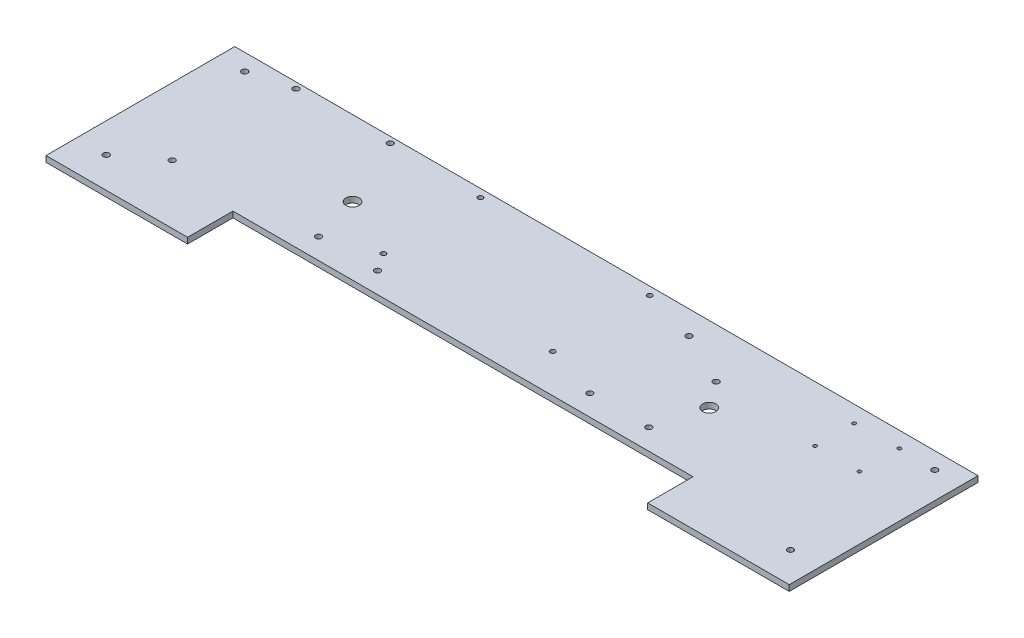
ISO-10303-21;
HEADER;
FILE_DESCRIPTION(('STEP AP214'),'2;1');
FILE_NAME('part.step','',(''),(''),'','','');
FILE_SCHEMA(('AUTOMOTIVE_DESIGN { 1 0 10303 214 1 1 1 1 }'));
ENDSEC;
DATA;
#1=APPLICATION_CONTEXT('core data for automotive mechanical design processes');
#2=APPLICATION_PROTOCOL_DEFINITION('international standard','automotive_design',2000,#1);
#3=PRODUCT_CONTEXT('',#1,'mechanical');
#4=PRODUCT('Part','Part','',(#3));
#5=PRODUCT_RELATED_PRODUCT_CATEGORY('part','',(#4));
#6=PRODUCT_DEFINITION_FORMATION('','',#4);
#7=PRODUCT_DEFINITION_CONTEXT('part definition',#1,'design');
#8=PRODUCT_DEFINITION('design','',#6,#7);
#9=PRODUCT_DEFINITION_SHAPE('','',#8);
#10=(LENGTH_UNIT() NAMED_UNIT(*) SI_UNIT(.MILLI.,.METRE.));
#11=(NAMED_UNIT(*) PLANE_ANGLE_UNIT() SI_UNIT($,.RADIAN.));
#12=(NAMED_UNIT(*) SI_UNIT($,.STERADIAN.) SOLID_ANGLE_UNIT());
#13=UNCERTAINTY_MEASURE_WITH_UNIT(LENGTH_MEASURE(1.E-05),#10,'distance_accuracy_value','');
#14=(GEOMETRIC_REPRESENTATION_CONTEXT(3) GLOBAL_UNCERTAINTY_ASSIGNED_CONTEXT((#13)) GLOBAL_UNIT_ASSIGNED_CONTEXT((#10,
#11,#12)) REPRESENTATION_CONTEXT('',''));
#15=CARTESIAN_POINT('',(0.,0.,0.));
#16=DIRECTION('',(0.,0.,1.));
#17=DIRECTION('',(1.,0.,0.));
#18=AXIS2_PLACEMENT_3D('',#15,#16,#17);
#19=CARTESIAN_POINT('',(647.7,6.35,48.8187999999998));
#20=DIRECTION('',(-1.,0.,0.));
#21=DIRECTION('',(0.,0.,1.));
#22=AXIS2_PLACEMENT_3D('',#19,#20,#21);
#23=PLANE('',#22);
#24=DIRECTION('',(0.,0.,-1.));
#25=VECTOR('',#24,1.);
#26=CARTESIAN_POINT('',(647.7,0.,48.8187999999998));
#27=LINE('',#26,#25);
#28=CARTESIAN_POINT('',(647.7,0.,48.8187999999998));
#29=VERTEX_POINT('',#28);
#30=CARTESIAN_POINT('',(647.7,0.,-154.3812));
#31=VERTEX_POINT('',#30);
#32=EDGE_CURVE('E136',#29,#31,#27,.T.);
#33=ORIENTED_EDGE('',*,*,#32,.T.);
#34=DIRECTION('',(0.,-1.,0.));
#35=VECTOR('',#34,1.);
#36=CARTESIAN_POINT('',(647.7,6.35,-154.3812));
#37=LINE('',#36,#35);
#38=CARTESIAN_POINT('',(647.7,6.35,-154.3812));
#39=VERTEX_POINT('',#38);
#40=EDGE_CURVE('E12',#39,#31,#37,.T.);
#41=ORIENTED_EDGE('',*,*,#40,.F.);
#42=DIRECTION('',(0.,0.,-1.));
#43=VECTOR('',#42,1.);
#44=CARTESIAN_POINT('',(647.7,6.35,48.8187999999998));
#45=LINE('',#44,#43);
#46=CARTESIAN_POINT('',(647.7,6.35,48.8187999999998));
#47=VERTEX_POINT('',#46);
#48=EDGE_CURVE('E426',#47,#39,#45,.T.);
#49=ORIENTED_EDGE('',*,*,#48,.F.);
#50=DIRECTION('',(0.,-1.,0.));
#51=VECTOR('',#50,1.);
#52=CARTESIAN_POINT('',(647.7,6.35,48.8187999999998));
#53=LINE('',#52,#51);
#54=EDGE_CURVE('E132',#47,#29,#53,.T.);
#55=ORIENTED_EDGE('',*,*,#54,.T.);
#56=EDGE_LOOP('',(#33,#41,#49,#55));
#57=FACE_BOUND('',#56,.T.);
#58=ADVANCED_FACE('F37',(#57),#23,.F.);
#59=CARTESIAN_POINT('',(647.7,6.35,-154.3812));
#60=DIRECTION('',(0.,0.,1.));
#61=DIRECTION('',(1.,0.,0.));
#62=AXIS2_PLACEMENT_3D('',#59,#60,#61);
#63=PLANE('',#62);
#64=DIRECTION('',(-1.,0.,0.));
#65=VECTOR('',#64,1.);
#66=CARTESIAN_POINT('',(647.7,0.,-154.3812));
#67=LINE('',#66,#65);
#68=CARTESIAN_POINT('',(-152.4,0.,-154.3812));
#69=VERTEX_POINT('',#68);
#70=EDGE_CURVE('E139',#31,#69,#67,.T.);
#71=ORIENTED_EDGE('',*,*,#70,.T.);
#72=DIRECTION('',(0.,-1.,0.));
#73=VECTOR('',#72,1.);
#74=CARTESIAN_POINT('',(-152.4,6.35,-154.3812));
#75=LINE('',#74,#73);
#76=CARTESIAN_POINT('',(-152.4,6.35,-154.3812));
#77=VERTEX_POINT('',#76);
#78=EDGE_CURVE('E47',#77,#69,#75,.T.);
#79=ORIENTED_EDGE('',*,*,#78,.F.);
#80=DIRECTION('',(-1.,0.,0.));
#81=VECTOR('',#80,1.);
#82=CARTESIAN_POINT('',(647.7,6.35,-154.3812));
#83=LINE('',#82,#81);
#84=EDGE_CURVE('E99',#39,#77,#83,.T.);
#85=ORIENTED_EDGE('',*,*,#84,.F.);
#86=ORIENTED_EDGE('',*,*,#40,.T.);
#87=EDGE_LOOP('',(#71,#79,#85,#86));
#88=FACE_BOUND('',#87,.T.);
#89=ADVANCED_FACE('F453',(#88),#63,.F.);
#90=CARTESIAN_POINT('',(-152.4,6.35,48.8188));
#91=DIRECTION('',(-1.,0.,0.));
#92=DIRECTION('',(0.,0.,1.));
#93=AXIS2_PLACEMENT_3D('',#90,#91,#92);
#94=PLANE('',#93);
#95=DIRECTION('',(0.,0.,-1.));
#96=VECTOR('',#95,1.);
#97=CARTESIAN_POINT('',(-152.4,0.,48.8188));
#98=LINE('',#97,#96);
#99=CARTESIAN_POINT('',(-152.4,0.,48.8188));
#100=VERTEX_POINT('',#99);
#101=EDGE_CURVE('E144',#100,#69,#98,.T.);
#102=ORIENTED_EDGE('',*,*,#101,.F.);
#103=DIRECTION('',(0.,-1.,0.));
#104=VECTOR('',#103,1.);
#105=CARTESIAN_POINT('',(-152.4,6.35,48.8188));
#106=LINE('',#105,#104);
#107=CARTESIAN_POINT('',(-152.4,6.35,48.8188));
#108=VERTEX_POINT('',#107);
#109=EDGE_CURVE('E443',#108,#100,#106,.T.);
#110=ORIENTED_EDGE('',*,*,#109,.F.);
#111=DIRECTION('',(0.,0.,-1.));
#112=VECTOR('',#111,1.);
#113=CARTESIAN_POINT('',(-152.4,6.35,48.8188));
#114=LINE('',#113,#112);
#115=EDGE_CURVE('E430',#108,#77,#114,.T.);
#116=ORIENTED_EDGE('',*,*,#115,.T.);
#117=ORIENTED_EDGE('',*,*,#78,.T.);
#118=EDGE_LOOP('',(#102,#110,#116,#117));
#119=FACE_BOUND('',#118,.T.);
#120=ADVANCED_FACE('F449',(#119),#94,.T.);
#121=CARTESIAN_POINT('',(0.,6.35,48.8188));
#122=DIRECTION('',(0.,0.,1.));
#123=DIRECTION('',(1.,0.,0.));
#124=AXIS2_PLACEMENT_3D('',#121,#122,#123);
#125=PLANE('',#124);
#126=DIRECTION('',(-1.,0.,0.));
#127=VECTOR('',#126,1.);
#128=CARTESIAN_POINT('',(0.,0.,48.8188));
#129=LINE('',#128,#127);
#130=CARTESIAN_POINT('',(0.,0.,48.8188));
#131=VERTEX_POINT('',#130);
#132=EDGE_CURVE('E457',#131,#100,#129,.T.);
#133=ORIENTED_EDGE('',*,*,#132,.F.);
#134=DIRECTION('',(0.,-1.,0.));
#135=VECTOR('',#134,1.);
#136=CARTESIAN_POINT('',(0.,6.35,48.8188));
#137=LINE('',#136,#135);
#138=CARTESIAN_POINT('',(0.,6.35,48.8188));
#139=VERTEX_POINT('',#138);
#140=EDGE_CURVE('E438',#139,#131,#137,.T.);
#141=ORIENTED_EDGE('',*,*,#140,.F.);
#142=DIRECTION('',(-1.,0.,0.));
#143=VECTOR('',#142,1.);
#144=CARTESIAN_POINT('',(0.,6.35,48.8188));
#145=LINE('',#144,#143);
#146=EDGE_CURVE('E433',#139,#108,#145,.T.);
#147=ORIENTED_EDGE('',*,*,#146,.T.);
#148=ORIENTED_EDGE('',*,*,#109,.T.);
#149=EDGE_LOOP('',(#133,#141,#147,#148));
#150=FACE_BOUND('',#149,.T.);
#151=ADVANCED_FACE('F466',(#150),#125,.T.);
#152=CARTESIAN_POINT('',(0.,6.35,0.));
#153=DIRECTION('',(1.,0.,0.));
#154=DIRECTION('',(0.,0.,-1.));
#155=AXIS2_PLACEMENT_3D('',#152,#153,#154);
#156=PLANE('',#155);
#157=DIRECTION('',(0.,0.,1.));
#158=VECTOR('',#157,1.);
#159=CARTESIAN_POINT('',(0.,0.,0.));
#160=LINE('',#159,#158);
#161=CARTESIAN_POINT('',(0.,0.,0.));
#162=VERTEX_POINT('',#161);
#163=EDGE_CURVE('E441',#162,#131,#160,.T.);
#164=ORIENTED_EDGE('',*,*,#163,.F.);
#165=DIRECTION('',(0.,-1.,0.));
#166=VECTOR('',#165,1.);
#167=CARTESIAN_POINT('',(0.,6.35,0.));
#168=LINE('',#167,#166);
#169=CARTESIAN_POINT('',(0.,6.35,0.));
#170=VERTEX_POINT('',#169);
#171=EDGE_CURVE('E127',#170,#162,#168,.T.);
#172=ORIENTED_EDGE('',*,*,#171,.F.);
#173=DIRECTION('',(0.,0.,1.));
#174=VECTOR('',#173,1.);
#175=CARTESIAN_POINT('',(0.,6.35,0.));
#176=LINE('',#175,#174);
#177=EDGE_CURVE('E120',#170,#139,#176,.T.);
#178=ORIENTED_EDGE('',*,*,#177,.T.);
#179=ORIENTED_EDGE('',*,*,#140,.T.);
#180=EDGE_LOOP('',(#164,#172,#178,#179));
#181=FACE_BOUND('',#180,.T.);
#182=ADVANCED_FACE('F437',(#181),#156,.T.);
#183=CARTESIAN_POINT('',(0.,6.35,0.));
#184=DIRECTION('',(0.,0.,-1.));
#185=DIRECTION('',(-1.,0.,0.));
#186=AXIS2_PLACEMENT_3D('',#183,#184,#185);
#187=PLANE('',#186);
#188=DIRECTION('',(1.,0.,0.));
#189=VECTOR('',#188,1.);
#190=CARTESIAN_POINT('',(0.,0.,0.));
#191=LINE('',#190,#189);
#192=CARTESIAN_POINT('',(495.3,0.,-1.16215651120435E-13));
#193=VERTEX_POINT('',#192);
#194=EDGE_CURVE('E126',#162,#193,#191,.T.);
#195=ORIENTED_EDGE('',*,*,#194,.T.);
#196=DIRECTION('',(0.,-1.,0.));
#197=VECTOR('',#196,1.);
#198=CARTESIAN_POINT('',(495.3,6.35,-1.16215651120435E-13));
#199=LINE('',#198,#197);
#200=CARTESIAN_POINT('',(495.3,6.35,-1.16215651120435E-13));
#201=VERTEX_POINT('',#200);
#202=EDGE_CURVE('E123',#201,#193,#199,.T.);
#203=ORIENTED_EDGE('',*,*,#202,.F.);
#204=DIRECTION('',(1.,0.,0.));
#205=VECTOR('',#204,1.);
#206=CARTESIAN_POINT('',(0.,6.35,0.));
#207=LINE('',#206,#205);
#208=EDGE_CURVE('E113',#170,#201,#207,.T.);
#209=ORIENTED_EDGE('',*,*,#208,.F.);
#210=ORIENTED_EDGE('',*,*,#171,.T.);
#211=EDGE_LOOP('',(#195,#203,#209,#210));
#212=FACE_BOUND('',#211,.T.);
#213=ADVANCED_FACE('F124',(#212),#187,.F.);
#214=CARTESIAN_POINT('',(495.3,6.35,-1.16215651120435E-13));
#215=DIRECTION('',(1.,0.,0.));
#216=DIRECTION('',(0.,0.,-1.));
#217=AXIS2_PLACEMENT_3D('',#214,#215,#216);
#218=PLANE('',#217);
#219=DIRECTION('',(0.,0.,1.));
#220=VECTOR('',#219,1.);
#221=CARTESIAN_POINT('',(495.3,0.,-1.16215651120435E-13));
#222=LINE('',#221,#220);
#223=CARTESIAN_POINT('',(495.3,0.,48.8187999999999));
#224=VERTEX_POINT('',#223);
#225=EDGE_CURVE('E85',#193,#224,#222,.T.);
#226=ORIENTED_EDGE('',*,*,#225,.T.);
#227=DIRECTION('',(0.,-1.,0.));
#228=VECTOR('',#227,1.);
#229=CARTESIAN_POINT('',(495.3,6.35,48.8187999999999));
#230=LINE('',#229,#228);
#231=CARTESIAN_POINT('',(495.3,6.35,48.8187999999999));
#232=VERTEX_POINT('',#231);
#233=EDGE_CURVE('E128',#232,#224,#230,.T.);
#234=ORIENTED_EDGE('',*,*,#233,.F.);
#235=DIRECTION('',(0.,0.,1.));
#236=VECTOR('',#235,1.);
#237=CARTESIAN_POINT('',(495.3,6.35,-1.16215651120435E-13));
#238=LINE('',#237,#236);
#239=EDGE_CURVE('E117',#201,#232,#238,.T.);
#240=ORIENTED_EDGE('',*,*,#239,.F.);
#241=ORIENTED_EDGE('',*,*,#202,.T.);
#242=EDGE_LOOP('',(#226,#234,#240,#241));
#243=FACE_BOUND('',#242,.T.);
#244=ADVANCED_FACE('F130',(#243),#218,.F.);
#245=CARTESIAN_POINT('',(495.3,6.35,48.8187999999999));
#246=DIRECTION('',(0.,0.,-1.));
#247=DIRECTION('',(-1.,0.,0.));
#248=AXIS2_PLACEMENT_3D('',#245,#246,#247);
#249=PLANE('',#248);
#250=DIRECTION('',(1.,0.,0.));
#251=VECTOR('',#250,1.);
#252=CARTESIAN_POINT('',(495.3,0.,48.8187999999999));
#253=LINE('',#252,#251);
#254=EDGE_CURVE('E91',#224,#29,#253,.T.);
#255=ORIENTED_EDGE('',*,*,#254,.T.);
#256=ORIENTED_EDGE('',*,*,#54,.F.);
#257=DIRECTION('',(1.,0.,0.));
#258=VECTOR('',#257,1.);
#259=CARTESIAN_POINT('',(495.3,6.35,48.8187999999999));
#260=LINE('',#259,#258);
#261=EDGE_CURVE('E56',#232,#47,#260,.T.);
#262=ORIENTED_EDGE('',*,*,#261,.F.);
#263=ORIENTED_EDGE('',*,*,#233,.T.);
#264=EDGE_LOOP('',(#255,#256,#262,#263));
#265=FACE_BOUND('',#264,.T.);
#266=ADVANCED_FACE('F406',(#265),#249,.F.);
#267=CARTESIAN_POINT('',(0.,6.35,0.));
#268=DIRECTION('',(0.,1.,0.));
#269=DIRECTION('',(0.,0.,1.));
#270=AXIS2_PLACEMENT_3D('',#267,#268,#269);
#271=PLANE('',#270);
#272=CARTESIAN_POINT('',(425.45,6.35,-22.3012));
#273=DIRECTION('',(0.,1.,0.));
#274=DIRECTION('',(0.,0.,1.));
#275=AXIS2_PLACEMENT_3D('',#272,#273,#274);
#276=CIRCLE('',#275,3.17499999999997);
#277=CARTESIAN_POINT('',(425.45,6.35,-19.1262));
#278=VERTEX_POINT('',#277);
#279=EDGE_CURVE('E365',#278,#278,#276,.T.);
#280=ORIENTED_EDGE('',*,*,#279,.F.);
#281=EDGE_LOOP('',(#280));
#282=FACE_BOUND('',#281,.T.);
#283=CARTESIAN_POINT('',(361.95,6.35,-22.3012));
#284=DIRECTION('',(0.,1.,0.));
#285=DIRECTION('',(0.,0.,1.));
#286=AXIS2_PLACEMENT_3D('',#283,#284,#285);
#287=CIRCLE('',#286,3.17499999999997);
#288=CARTESIAN_POINT('',(361.95,6.35,-19.1262));
#289=VERTEX_POINT('',#288);
#290=EDGE_CURVE('E356',#289,#289,#287,.T.);
#291=ORIENTED_EDGE('',*,*,#290,.F.);
#292=EDGE_LOOP('',(#291));
#293=FACE_BOUND('',#292,.T.);
#294=CARTESIAN_POINT('',(419.1,6.35,-101.0412));
#295=DIRECTION('',(0.,1.,0.));
#296=DIRECTION('',(0.,0.,1.));
#297=AXIS2_PLACEMENT_3D('',#294,#295,#296);
#298=CIRCLE('',#297,3.17499999999997);
#299=CARTESIAN_POINT('',(419.1,6.35,-97.8662000000002));
#300=VERTEX_POINT('',#299);
#301=EDGE_CURVE('E350',#300,#300,#298,.T.);
#302=ORIENTED_EDGE('',*,*,#301,.F.);
#303=EDGE_LOOP('',(#302));
#304=FACE_BOUND('',#303,.T.);
#305=CARTESIAN_POINT('',(302.9204,6.35,-41.3512000000002));
#306=DIRECTION('',(0.,1.,0.));
#307=DIRECTION('',(0.,0.,1.));
#308=AXIS2_PLACEMENT_3D('',#305,#306,#307);
#309=CIRCLE('',#308,2.66699999999997);
#310=CARTESIAN_POINT('',(302.9204,6.35,-38.6842000000002));
#311=VERTEX_POINT('',#310);
#312=EDGE_CURVE('E223',#311,#311,#309,.T.);
#313=ORIENTED_EDGE('',*,*,#312,.F.);
#314=EDGE_LOOP('',(#313));
#315=FACE_BOUND('',#314,.T.);
#316=CARTESIAN_POINT('',(361.95,6.35,-128.9812));
#317=DIRECTION('',(0.,1.,0.));
#318=DIRECTION('',(0.,0.,1.));
#319=AXIS2_PLACEMENT_3D('',#316,#317,#318);
#320=CIRCLE('',#319,3.17499999999997);
#321=CARTESIAN_POINT('',(361.95,6.35,-125.8062));
#322=VERTEX_POINT('',#321);
#323=EDGE_CURVE('E215',#322,#322,#320,.T.);
#324=ORIENTED_EDGE('',*,*,#323,.F.);
#325=EDGE_LOOP('',(#324));
#326=FACE_BOUND('',#325,.T.);
#327=CARTESIAN_POINT('',(302.9204,6.35,-145.7452));
#328=DIRECTION('',(0.,1.,0.));
#329=DIRECTION('',(0.,0.,1.));
#330=AXIS2_PLACEMENT_3D('',#327,#328,#329);
#331=CIRCLE('',#330,2.66699999999997);
#332=CARTESIAN_POINT('',(302.9204,6.35,-143.0782));
#333=VERTEX_POINT('',#332);
#334=EDGE_CURVE('E214',#333,#333,#331,.T.);
#335=ORIENTED_EDGE('',*,*,#334,.F.);
#336=EDGE_LOOP('',(#335));
#337=FACE_BOUND('',#336,.T.);
#338=CARTESIAN_POINT('',(120.65,6.35,-145.7452));
#339=DIRECTION('',(0.,1.,0.));
#340=DIRECTION('',(0.,0.,1.));
#341=AXIS2_PLACEMENT_3D('',#338,#339,#340);
#342=CIRCLE('',#341,2.667);
#343=CARTESIAN_POINT('',(120.65,6.35,-143.0782));
#344=VERTEX_POINT('',#343);
#345=EDGE_CURVE('E782',#344,#344,#342,.T.);
#346=ORIENTED_EDGE('',*,*,#345,.F.);
#347=EDGE_LOOP('',(#346));
#348=FACE_BOUND('',#347,.T.);
#349=CARTESIAN_POINT('',(133.35,6.35,-22.3012));
#350=DIRECTION('',(0.,1.,0.));
#351=DIRECTION('',(0.,0.,1.));
#352=AXIS2_PLACEMENT_3D('',#349,#350,#351);
#353=CIRCLE('',#352,3.175);
#354=CARTESIAN_POINT('',(133.35,6.35,-19.1262));
#355=VERTEX_POINT('',#354);
#356=EDGE_CURVE('E201',#355,#355,#353,.T.);
#357=ORIENTED_EDGE('',*,*,#356,.F.);
#358=EDGE_LOOP('',(#357));
#359=FACE_BOUND('',#358,.T.);
#360=CARTESIAN_POINT('',(120.65,6.35,-41.3512000000002));
#361=DIRECTION('',(0.,1.,0.));
#362=DIRECTION('',(0.,0.,1.));
#363=AXIS2_PLACEMENT_3D('',#360,#361,#362);
#364=CIRCLE('',#363,2.667);
#365=CARTESIAN_POINT('',(120.65,6.35,-38.6842000000002));
#366=VERTEX_POINT('',#365);
#367=EDGE_CURVE('E200',#366,#366,#364,.T.);
#368=ORIENTED_EDGE('',*,*,#367,.F.);
#369=EDGE_LOOP('',(#368));
#370=FACE_BOUND('',#369,.T.);
#371=CARTESIAN_POINT('',(69.85,6.35,-22.3012));
#372=DIRECTION('',(0.,1.,0.));
#373=DIRECTION('',(0.,0.,1.));
#374=AXIS2_PLACEMENT_3D('',#371,#372,#373);
#375=CIRCLE('',#374,3.175);
#376=CARTESIAN_POINT('',(69.85,6.35,-19.1262));
#377=VERTEX_POINT('',#376);
#378=EDGE_CURVE('E183',#377,#377,#375,.T.);
#379=ORIENTED_EDGE('',*,*,#378,.F.);
#380=EDGE_LOOP('',(#379));
#381=FACE_BOUND('',#380,.T.);
#382=CARTESIAN_POINT('',(439.674,6.35,-73.1012000000002));
#383=DIRECTION('',(0.,1.,0.));
#384=DIRECTION('',(0.,0.,1.));
#385=AXIS2_PLACEMENT_3D('',#382,#383,#384);
#386=CIRCLE('',#385,7.14375000000002);
#387=CARTESIAN_POINT('',(439.674,6.35,-65.9574500000001));
#388=VERTEX_POINT('',#387);
#389=EDGE_CURVE('E182',#388,#388,#386,.T.);
#390=ORIENTED_EDGE('',*,*,#389,.F.);
#391=EDGE_LOOP('',(#390));
#392=FACE_BOUND('',#391,.T.);
#393=CARTESIAN_POINT('',(532.257,6.35,-136.41832));
#394=DIRECTION('',(0.,1.,0.));
#395=DIRECTION('',(0.,0.,1.));
#396=AXIS2_PLACEMENT_3D('',#393,#394,#395);
#397=CIRCLE('',#396,1.90500000000005);
#398=CARTESIAN_POINT('',(532.257,6.35,-134.51332));
#399=VERTEX_POINT('',#398);
#400=EDGE_CURVE('E322',#399,#399,#397,.T.);
#401=ORIENTED_EDGE('',*,*,#400,.F.);
#402=EDGE_LOOP('',(#401));
#403=FACE_BOUND('',#402,.T.);
#404=CARTESIAN_POINT('',(580.009,6.35,-94.4118000000002));
#405=DIRECTION('',(0.,1.,0.));
#406=DIRECTION('',(0.,0.,1.));
#407=AXIS2_PLACEMENT_3D('',#404,#405,#406);
#408=CIRCLE('',#407,1.90500000000005);
#409=CARTESIAN_POINT('',(580.009,6.35,-92.5068000000002));
#410=VERTEX_POINT('',#409);
#411=EDGE_CURVE('E326',#410,#410,#408,.T.);
#412=ORIENTED_EDGE('',*,*,#411,.F.);
#413=EDGE_LOOP('',(#412));
#414=FACE_BOUND('',#413,.T.);
#415=CARTESIAN_POINT('',(532.257,6.35,-94.4118000000002));
#416=DIRECTION('',(0.,1.,0.));
#417=DIRECTION('',(0.,0.,1.));
#418=AXIS2_PLACEMENT_3D('',#415,#416,#417);
#419=CIRCLE('',#418,1.90500000000005);
#420=CARTESIAN_POINT('',(532.257,6.35,-92.5068000000001));
#421=VERTEX_POINT('',#420);
#422=EDGE_CURVE('E245',#421,#421,#419,.T.);
#423=ORIENTED_EDGE('',*,*,#422,.F.);
#424=EDGE_LOOP('',(#423));
#425=FACE_BOUND('',#424,.T.);
#426=CARTESIAN_POINT('',(580.009,6.35,-137.4648));
#427=DIRECTION('',(0.,1.,0.));
#428=DIRECTION('',(0.,0.,1.));
#429=AXIS2_PLACEMENT_3D('',#426,#427,#428);
#430=CIRCLE('',#429,1.90500000000005);
#431=CARTESIAN_POINT('',(580.009,6.35,-135.5598));
#432=VERTEX_POINT('',#431);
#433=EDGE_CURVE('E244',#432,#432,#430,.T.);
#434=ORIENTED_EDGE('',*,*,#433,.F.);
#435=EDGE_LOOP('',(#434));
#436=FACE_BOUND('',#435,.T.);
#437=CARTESIAN_POINT('',(615.95,6.35,15.7987999999999));
#438=DIRECTION('',(0.,1.,0.));
#439=DIRECTION('',(0.,0.,1.));
#440=AXIS2_PLACEMENT_3D('',#437,#438,#439);
#441=CIRCLE('',#440,3.17500000000008);
#442=CARTESIAN_POINT('',(615.95,6.35,18.9738));
#443=VERTEX_POINT('',#442);
#444=EDGE_CURVE('E333',#443,#443,#441,.T.);
#445=ORIENTED_EDGE('',*,*,#444,.F.);
#446=EDGE_LOOP('',(#445));
#447=FACE_BOUND('',#446,.T.);
#448=CARTESIAN_POINT('',(619.125,6.35,-136.41832));
#449=DIRECTION('',(0.,1.,0.));
#450=DIRECTION('',(0.,0.,1.));
#451=AXIS2_PLACEMENT_3D('',#448,#449,#450);
#452=CIRCLE('',#451,3.17500000000009);
#453=CARTESIAN_POINT('',(619.125,6.35,-133.24332));
#454=VERTEX_POINT('',#453);
#455=EDGE_CURVE('E337',#454,#454,#452,.T.);
#456=ORIENTED_EDGE('',*,*,#455,.F.);
#457=EDGE_LOOP('',(#456));
#458=FACE_BOUND('',#457,.T.);
#459=CARTESIAN_POINT('',(55.626,6.35,-73.1012));
#460=DIRECTION('',(0.,1.,0.));
#461=DIRECTION('',(0.,0.,1.));
#462=AXIS2_PLACEMENT_3D('',#459,#460,#461);
#463=CIRCLE('',#462,7.14375);
#464=CARTESIAN_POINT('',(55.626,6.35,-65.95745));
#465=VERTEX_POINT('',#464);
#466=EDGE_CURVE('E305',#465,#465,#463,.T.);
#467=ORIENTED_EDGE('',*,*,#466,.F.);
#468=EDGE_LOOP('',(#467));
#469=FACE_BOUND('',#468,.T.);
#470=CARTESIAN_POINT('',(21.463,6.35,-147.980400000001));
#471=DIRECTION('',(0.,1.,0.));
#472=DIRECTION('',(0.,0.,1.));
#473=AXIS2_PLACEMENT_3D('',#470,#471,#472);
#474=CIRCLE('',#473,3.175);
#475=CARTESIAN_POINT('',(21.463,6.35,-144.805400000001));
#476=VERTEX_POINT('',#475);
#477=EDGE_CURVE('E160',#476,#476,#474,.T.);
#478=ORIENTED_EDGE('',*,*,#477,.F.);
#479=EDGE_LOOP('',(#478));
#480=FACE_BOUND('',#479,.T.);
#481=CARTESIAN_POINT('',(-80.0608,6.35,-147.9804));
#482=DIRECTION('',(0.,1.,0.));
#483=DIRECTION('',(0.,0.,1.));
#484=AXIS2_PLACEMENT_3D('',#481,#482,#483);
#485=CIRCLE('',#484,3.175);
#486=CARTESIAN_POINT('',(-80.0608,6.35,-144.8054));
#487=VERTEX_POINT('',#486);
#488=EDGE_CURVE('E159',#487,#487,#485,.T.);
#489=ORIENTED_EDGE('',*,*,#488,.F.);
#490=EDGE_LOOP('',(#489));
#491=FACE_BOUND('',#490,.T.);
#492=CARTESIAN_POINT('',(-123.825,6.35,-136.41832));
#493=DIRECTION('',(0.,1.,0.));
#494=DIRECTION('',(0.,0.,1.));
#495=AXIS2_PLACEMENT_3D('',#492,#493,#494);
#496=CIRCLE('',#495,3.30200000000001);
#497=CARTESIAN_POINT('',(-123.825,6.35,-133.11632));
#498=VERTEX_POINT('',#497);
#499=EDGE_CURVE('E276',#498,#498,#496,.T.);
#500=ORIENTED_EDGE('',*,*,#499,.F.);
#501=EDGE_LOOP('',(#500));
#502=FACE_BOUND('',#501,.T.);
#503=CARTESIAN_POINT('',(-80.0608,6.35,-14.6304));
#504=DIRECTION('',(0.,1.,0.));
#505=DIRECTION('',(0.,0.,1.));
#506=AXIS2_PLACEMENT_3D('',#503,#504,#505);
#507=CIRCLE('',#506,3.175);
#508=CARTESIAN_POINT('',(-80.0608,6.35,-11.4554));
#509=VERTEX_POINT('',#508);
#510=EDGE_CURVE('E275',#509,#509,#507,.T.);
#511=ORIENTED_EDGE('',*,*,#510,.F.);
#512=EDGE_LOOP('',(#511));
#513=FACE_BOUND('',#512,.T.);
#514=CARTESIAN_POINT('',(-120.65,6.35,15.7988));
#515=DIRECTION('',(0.,1.,0.));
#516=DIRECTION('',(0.,0.,1.));
#517=AXIS2_PLACEMENT_3D('',#514,#515,#516);
#518=CIRCLE('',#517,3.30200000000001);
#519=CARTESIAN_POINT('',(-120.65,6.35,19.1008));
#520=VERTEX_POINT('',#519);
#521=EDGE_CURVE('E264',#520,#520,#518,.T.);
#522=ORIENTED_EDGE('',*,*,#521,.F.);
#523=EDGE_LOOP('',(#522));
#524=FACE_BOUND('',#523,.T.);
#525=ORIENTED_EDGE('',*,*,#48,.T.);
#526=ORIENTED_EDGE('',*,*,#84,.T.);
#527=ORIENTED_EDGE('',*,*,#115,.F.);
#528=ORIENTED_EDGE('',*,*,#146,.F.);
#529=ORIENTED_EDGE('',*,*,#177,.F.);
#530=ORIENTED_EDGE('',*,*,#208,.T.);
#531=ORIENTED_EDGE('',*,*,#239,.T.);
#532=ORIENTED_EDGE('',*,*,#261,.T.);
#533=EDGE_LOOP('',(#525,#526,#527,#528,#529,#530,#531,#532));
#534=FACE_BOUND('',#533,.T.);
#535=ADVANCED_FACE('F115',(#282,#293,#304,#315,#326,#337,#348,#359,#370,#381,#392,#403,#414,
#425,#436,#447,#458,#469,#480,#491,#502,#513,#524,#534),#271,.T.);
#536=CARTESIAN_POINT('',(0.,0.,0.));
#537=DIRECTION('',(0.,1.,0.));
#538=DIRECTION('',(0.,0.,1.));
#539=AXIS2_PLACEMENT_3D('',#536,#537,#538);
#540=PLANE('',#539);
#541=CARTESIAN_POINT('',(425.45,0.,-22.3012));
#542=DIRECTION('',(0.,1.,0.));
#543=DIRECTION('',(0.,0.,1.));
#544=AXIS2_PLACEMENT_3D('',#541,#542,#543);
#545=CIRCLE('',#544,3.17499999999997);
#546=CARTESIAN_POINT('',(425.45,0.,-19.1262));
#547=VERTEX_POINT('',#546);
#548=EDGE_CURVE('E40',#547,#547,#545,.T.);
#549=ORIENTED_EDGE('',*,*,#548,.T.);
#550=EDGE_LOOP('',(#549));
#551=FACE_BOUND('',#550,.T.);
#552=CARTESIAN_POINT('',(361.95,0.,-22.3012));
#553=DIRECTION('',(0.,1.,0.));
#554=DIRECTION('',(0.,0.,1.));
#555=AXIS2_PLACEMENT_3D('',#552,#553,#554);
#556=CIRCLE('',#555,3.17499999999997);
#557=CARTESIAN_POINT('',(361.95,0.,-19.1262));
#558=VERTEX_POINT('',#557);
#559=EDGE_CURVE('E355',#558,#558,#556,.T.);
#560=ORIENTED_EDGE('',*,*,#559,.T.);
#561=EDGE_LOOP('',(#560));
#562=FACE_BOUND('',#561,.T.);
#563=CARTESIAN_POINT('',(419.1,0.,-101.0412));
#564=DIRECTION('',(0.,1.,0.));
#565=DIRECTION('',(0.,0.,1.));
#566=AXIS2_PLACEMENT_3D('',#563,#564,#565);
#567=CIRCLE('',#566,3.17499999999997);
#568=CARTESIAN_POINT('',(419.1,0.,-97.8662000000002));
#569=VERTEX_POINT('',#568);
#570=EDGE_CURVE('E224',#569,#569,#567,.T.);
#571=ORIENTED_EDGE('',*,*,#570,.T.);
#572=EDGE_LOOP('',(#571));
#573=FACE_BOUND('',#572,.T.);
#574=CARTESIAN_POINT('',(302.9204,0.,-41.3512000000002));
#575=DIRECTION('',(0.,1.,0.));
#576=DIRECTION('',(0.,0.,1.));
#577=AXIS2_PLACEMENT_3D('',#574,#575,#576);
#578=CIRCLE('',#577,2.66699999999997);
#579=CARTESIAN_POINT('',(302.9204,0.,-38.6842000000002));
#580=VERTEX_POINT('',#579);
#581=EDGE_CURVE('E218',#580,#580,#578,.T.);
#582=ORIENTED_EDGE('',*,*,#581,.T.);
#583=EDGE_LOOP('',(#582));
#584=FACE_BOUND('',#583,.T.);
#585=CARTESIAN_POINT('',(361.95,0.,-128.9812));
#586=DIRECTION('',(0.,1.,0.));
#587=DIRECTION('',(0.,0.,1.));
#588=AXIS2_PLACEMENT_3D('',#585,#586,#587);
#589=CIRCLE('',#588,3.17499999999997);
#590=CARTESIAN_POINT('',(361.95,0.,-125.8062));
#591=VERTEX_POINT('',#590);
#592=EDGE_CURVE('E210',#591,#591,#589,.T.);
#593=ORIENTED_EDGE('',*,*,#592,.T.);
#594=EDGE_LOOP('',(#593));
#595=FACE_BOUND('',#594,.T.);
#596=CARTESIAN_POINT('',(302.9204,0.,-145.7452));
#597=DIRECTION('',(0.,1.,0.));
#598=DIRECTION('',(0.,0.,1.));
#599=AXIS2_PLACEMENT_3D('',#596,#597,#598);
#600=CIRCLE('',#599,2.66699999999997);
#601=CARTESIAN_POINT('',(302.9204,0.,-143.0782));
#602=VERTEX_POINT('',#601);
#603=EDGE_CURVE('E216',#602,#602,#600,.T.);
#604=ORIENTED_EDGE('',*,*,#603,.T.);
#605=EDGE_LOOP('',(#604));
#606=FACE_BOUND('',#605,.T.);
#607=CARTESIAN_POINT('',(120.65,0.,-145.7452));
#608=DIRECTION('',(0.,1.,0.));
#609=DIRECTION('',(0.,0.,1.));
#610=AXIS2_PLACEMENT_3D('',#607,#608,#609);
#611=CIRCLE('',#610,2.667);
#612=CARTESIAN_POINT('',(120.65,0.,-143.0782));
#613=VERTEX_POINT('',#612);
#614=EDGE_CURVE('E202',#613,#613,#611,.T.);
#615=ORIENTED_EDGE('',*,*,#614,.T.);
#616=EDGE_LOOP('',(#615));
#617=FACE_BOUND('',#616,.T.);
#618=CARTESIAN_POINT('',(133.35,0.,-22.3012));
#619=DIRECTION('',(0.,1.,0.));
#620=DIRECTION('',(0.,0.,1.));
#621=AXIS2_PLACEMENT_3D('',#618,#619,#620);
#622=CIRCLE('',#621,3.175);
#623=CARTESIAN_POINT('',(133.35,0.,-19.1262));
#624=VERTEX_POINT('',#623);
#625=EDGE_CURVE('E197',#624,#624,#622,.T.);
#626=ORIENTED_EDGE('',*,*,#625,.T.);
#627=EDGE_LOOP('',(#626));
#628=FACE_BOUND('',#627,.T.);
#629=CARTESIAN_POINT('',(120.65,0.,-41.3512000000002));
#630=DIRECTION('',(0.,1.,0.));
#631=DIRECTION('',(0.,0.,1.));
#632=AXIS2_PLACEMENT_3D('',#629,#630,#631);
#633=CIRCLE('',#632,2.667);
#634=CARTESIAN_POINT('',(120.65,0.,-38.6842000000002));
#635=VERTEX_POINT('',#634);
#636=EDGE_CURVE('E187',#635,#635,#633,.T.);
#637=ORIENTED_EDGE('',*,*,#636,.T.);
#638=EDGE_LOOP('',(#637));
#639=FACE_BOUND('',#638,.T.);
#640=CARTESIAN_POINT('',(69.85,0.,-22.3012));
#641=DIRECTION('',(0.,1.,0.));
#642=DIRECTION('',(0.,0.,1.));
#643=AXIS2_PLACEMENT_3D('',#640,#641,#642);
#644=CIRCLE('',#643,3.175);
#645=CARTESIAN_POINT('',(69.85,0.,-19.1262));
#646=VERTEX_POINT('',#645);
#647=EDGE_CURVE('E178',#646,#646,#644,.T.);
#648=ORIENTED_EDGE('',*,*,#647,.T.);
#649=EDGE_LOOP('',(#648));
#650=FACE_BOUND('',#649,.T.);
#651=CARTESIAN_POINT('',(439.674,0.,-73.1012000000002));
#652=DIRECTION('',(0.,1.,0.));
#653=DIRECTION('',(0.,0.,1.));
#654=AXIS2_PLACEMENT_3D('',#651,#652,#653);
#655=CIRCLE('',#654,7.14375000000002);
#656=CARTESIAN_POINT('',(439.674,0.,-65.9574500000001));
#657=VERTEX_POINT('',#656);
#658=EDGE_CURVE('E184',#657,#657,#655,.T.);
#659=ORIENTED_EDGE('',*,*,#658,.T.);
#660=EDGE_LOOP('',(#659));
#661=FACE_BOUND('',#660,.T.);
#662=CARTESIAN_POINT('',(532.257,0.,-136.41832));
#663=DIRECTION('',(0.,1.,0.));
#664=DIRECTION('',(0.,0.,1.));
#665=AXIS2_PLACEMENT_3D('',#662,#663,#664);
#666=CIRCLE('',#665,1.90500000000005);
#667=CARTESIAN_POINT('',(532.257,0.,-134.51332));
#668=VERTEX_POINT('',#667);
#669=EDGE_CURVE('E325',#668,#668,#666,.T.);
#670=ORIENTED_EDGE('',*,*,#669,.T.);
#671=EDGE_LOOP('',(#670));
#672=FACE_BOUND('',#671,.T.);
#673=CARTESIAN_POINT('',(580.009,0.,-94.4118000000002));
#674=DIRECTION('',(0.,1.,0.));
#675=DIRECTION('',(0.,0.,1.));
#676=AXIS2_PLACEMENT_3D('',#673,#674,#675);
#677=CIRCLE('',#676,1.90500000000005);
#678=CARTESIAN_POINT('',(580.009,0.,-92.5068000000002));
#679=VERTEX_POINT('',#678);
#680=EDGE_CURVE('E249',#679,#679,#677,.T.);
#681=ORIENTED_EDGE('',*,*,#680,.T.);
#682=EDGE_LOOP('',(#681));
#683=FACE_BOUND('',#682,.T.);
#684=CARTESIAN_POINT('',(532.257,0.,-94.4118000000002));
#685=DIRECTION('',(0.,1.,0.));
#686=DIRECTION('',(0.,0.,1.));
#687=AXIS2_PLACEMENT_3D('',#684,#685,#686);
#688=CIRCLE('',#687,1.90500000000005);
#689=CARTESIAN_POINT('',(532.257,0.,-92.5068000000001));
#690=VERTEX_POINT('',#689);
#691=EDGE_CURVE('E240',#690,#690,#688,.T.);
#692=ORIENTED_EDGE('',*,*,#691,.T.);
#693=EDGE_LOOP('',(#692));
#694=FACE_BOUND('',#693,.T.);
#695=CARTESIAN_POINT('',(580.009,0.,-137.4648));
#696=DIRECTION('',(0.,1.,0.));
#697=DIRECTION('',(0.,0.,1.));
#698=AXIS2_PLACEMENT_3D('',#695,#696,#697);
#699=CIRCLE('',#698,1.90500000000005);
#700=CARTESIAN_POINT('',(580.009,0.,-135.5598));
#701=VERTEX_POINT('',#700);
#702=EDGE_CURVE('E246',#701,#701,#699,.T.);
#703=ORIENTED_EDGE('',*,*,#702,.T.);
#704=EDGE_LOOP('',(#703));
#705=FACE_BOUND('',#704,.T.);
#706=CARTESIAN_POINT('',(615.95,0.,15.7987999999999));
#707=DIRECTION('',(0.,1.,0.));
#708=DIRECTION('',(0.,0.,1.));
#709=AXIS2_PLACEMENT_3D('',#706,#707,#708);
#710=CIRCLE('',#709,3.17500000000008);
#711=CARTESIAN_POINT('',(615.95,0.,18.9738));
#712=VERTEX_POINT('',#711);
#713=EDGE_CURVE('E336',#712,#712,#710,.T.);
#714=ORIENTED_EDGE('',*,*,#713,.T.);
#715=EDGE_LOOP('',(#714));
#716=FACE_BOUND('',#715,.T.);
#717=CARTESIAN_POINT('',(619.125,0.,-136.41832));
#718=DIRECTION('',(0.,1.,0.));
#719=DIRECTION('',(0.,0.,1.));
#720=AXIS2_PLACEMENT_3D('',#717,#718,#719);
#721=CIRCLE('',#720,3.17500000000009);
#722=CARTESIAN_POINT('',(619.125,0.,-133.24332));
#723=VERTEX_POINT('',#722);
#724=EDGE_CURVE('E385',#723,#723,#721,.T.);
#725=ORIENTED_EDGE('',*,*,#724,.T.);
#726=EDGE_LOOP('',(#725));
#727=FACE_BOUND('',#726,.T.);
#728=CARTESIAN_POINT('',(55.626,0.,-73.1012));
#729=DIRECTION('',(0.,1.,0.));
#730=DIRECTION('',(0.,0.,1.));
#731=AXIS2_PLACEMENT_3D('',#728,#729,#730);
#732=CIRCLE('',#731,7.14375);
#733=CARTESIAN_POINT('',(55.626,0.,-65.95745));
#734=VERTEX_POINT('',#733);
#735=EDGE_CURVE('E164',#734,#734,#732,.T.);
#736=ORIENTED_EDGE('',*,*,#735,.T.);
#737=EDGE_LOOP('',(#736));
#738=FACE_BOUND('',#737,.T.);
#739=CARTESIAN_POINT('',(21.463,0.,-147.980400000001));
#740=DIRECTION('',(0.,1.,0.));
#741=DIRECTION('',(0.,0.,1.));
#742=AXIS2_PLACEMENT_3D('',#739,#740,#741);
#743=CIRCLE('',#742,3.175);
#744=CARTESIAN_POINT('',(21.463,0.,-144.805400000001));
#745=VERTEX_POINT('',#744);
#746=EDGE_CURVE('E155',#745,#745,#743,.T.);
#747=ORIENTED_EDGE('',*,*,#746,.T.);
#748=EDGE_LOOP('',(#747));
#749=FACE_BOUND('',#748,.T.);
#750=CARTESIAN_POINT('',(-80.0608,0.,-147.9804));
#751=DIRECTION('',(0.,1.,0.));
#752=DIRECTION('',(0.,0.,1.));
#753=AXIS2_PLACEMENT_3D('',#750,#751,#752);
#754=CIRCLE('',#753,3.175);
#755=CARTESIAN_POINT('',(-80.0608,0.,-144.8054));
#756=VERTEX_POINT('',#755);
#757=EDGE_CURVE('E161',#756,#756,#754,.T.);
#758=ORIENTED_EDGE('',*,*,#757,.T.);
#759=EDGE_LOOP('',(#758));
#760=FACE_BOUND('',#759,.T.);
#761=CARTESIAN_POINT('',(-123.825,0.,-136.41832));
#762=DIRECTION('',(0.,1.,0.));
#763=DIRECTION('',(0.,0.,1.));
#764=AXIS2_PLACEMENT_3D('',#761,#762,#763);
#765=CIRCLE('',#764,3.30200000000001);
#766=CARTESIAN_POINT('',(-123.825,0.,-133.11632));
#767=VERTEX_POINT('',#766);
#768=EDGE_CURVE('E272',#767,#767,#765,.T.);
#769=ORIENTED_EDGE('',*,*,#768,.T.);
#770=EDGE_LOOP('',(#769));
#771=FACE_BOUND('',#770,.T.);
#772=CARTESIAN_POINT('',(-80.0608,0.,-14.6304));
#773=DIRECTION('',(0.,1.,0.));
#774=DIRECTION('',(0.,0.,1.));
#775=AXIS2_PLACEMENT_3D('',#772,#773,#774);
#776=CIRCLE('',#775,3.175);
#777=CARTESIAN_POINT('',(-80.0608,0.,-11.4554));
#778=VERTEX_POINT('',#777);
#779=EDGE_CURVE('E266',#778,#778,#776,.T.);
#780=ORIENTED_EDGE('',*,*,#779,.T.);
#781=EDGE_LOOP('',(#780));
#782=FACE_BOUND('',#781,.T.);
#783=CARTESIAN_POINT('',(-120.65,0.,15.7988));
#784=DIRECTION('',(0.,1.,0.));
#785=DIRECTION('',(0.,0.,1.));
#786=AXIS2_PLACEMENT_3D('',#783,#784,#785);
#787=CIRCLE('',#786,3.30200000000001);
#788=CARTESIAN_POINT('',(-120.65,0.,19.1008));
#789=VERTEX_POINT('',#788);
#790=EDGE_CURVE('E140',#789,#789,#787,.T.);
#791=ORIENTED_EDGE('',*,*,#790,.T.);
#792=EDGE_LOOP('',(#791));
#793=FACE_BOUND('',#792,.T.);
#794=ORIENTED_EDGE('',*,*,#32,.F.);
#795=ORIENTED_EDGE('',*,*,#254,.F.);
#796=ORIENTED_EDGE('',*,*,#225,.F.);
#797=ORIENTED_EDGE('',*,*,#194,.F.);
#798=ORIENTED_EDGE('',*,*,#163,.T.);
#799=ORIENTED_EDGE('',*,*,#132,.T.);
#800=ORIENTED_EDGE('',*,*,#101,.T.);
#801=ORIENTED_EDGE('',*,*,#70,.F.);
#802=EDGE_LOOP('',(#794,#795,#796,#797,#798,#799,#800,#801));
#803=FACE_BOUND('',#802,.T.);
#804=ADVANCED_FACE('F405',(#551,#562,#573,#584,#595,#606,#617,#628,#639,#650,#661,#672,#683,
#694,#705,#716,#727,#738,#749,#760,#771,#782,#793,#803),#540,.F.);
#805=CARTESIAN_POINT('',(-120.65,-1.27,15.7988));
#806=DIRECTION('',(0.,1.,0.));
#807=DIRECTION('',(0.,0.,1.));
#808=AXIS2_PLACEMENT_3D('',#805,#806,#807);
#809=CYLINDRICAL_SURFACE('',#808,3.30200000000001);
#810=ORIENTED_EDGE('',*,*,#521,.T.);
#811=EDGE_LOOP('',(#810));
#812=FACE_BOUND('',#811,.T.);
#813=ORIENTED_EDGE('',*,*,#790,.F.);
#814=EDGE_LOOP('',(#813));
#815=FACE_BOUND('',#814,.T.);
#816=ADVANCED_FACE('F525',(#812,#815),#809,.F.);
#817=CARTESIAN_POINT('',(-80.0608,-1.27,-14.6304));
#818=DIRECTION('',(0.,1.,0.));
#819=DIRECTION('',(0.,0.,1.));
#820=AXIS2_PLACEMENT_3D('',#817,#818,#819);
#821=CYLINDRICAL_SURFACE('',#820,3.175);
#822=ORIENTED_EDGE('',*,*,#510,.T.);
#823=EDGE_LOOP('',(#822));
#824=FACE_BOUND('',#823,.T.);
#825=ORIENTED_EDGE('',*,*,#779,.F.);
#826=EDGE_LOOP('',(#825));
#827=FACE_BOUND('',#826,.T.);
#828=ADVANCED_FACE('F530',(#824,#827),#821,.F.);
#829=CARTESIAN_POINT('',(-123.825,-1.27,-136.41832));
#830=DIRECTION('',(0.,1.,0.));
#831=DIRECTION('',(0.,0.,1.));
#832=AXIS2_PLACEMENT_3D('',#829,#830,#831);
#833=CYLINDRICAL_SURFACE('',#832,3.30200000000001);
#834=ORIENTED_EDGE('',*,*,#499,.T.);
#835=EDGE_LOOP('',(#834));
#836=FACE_BOUND('',#835,.T.);
#837=ORIENTED_EDGE('',*,*,#768,.F.);
#838=EDGE_LOOP('',(#837));
#839=FACE_BOUND('',#838,.T.);
#840=ADVANCED_FACE('F541',(#836,#839),#833,.F.);
#841=CARTESIAN_POINT('',(-80.0608,-1.27,-147.9804));
#842=DIRECTION('',(0.,1.,0.));
#843=DIRECTION('',(0.,0.,1.));
#844=AXIS2_PLACEMENT_3D('',#841,#842,#843);
#845=CYLINDRICAL_SURFACE('',#844,3.175);
#846=ORIENTED_EDGE('',*,*,#488,.T.);
#847=EDGE_LOOP('',(#846));
#848=FACE_BOUND('',#847,.T.);
#849=ORIENTED_EDGE('',*,*,#757,.F.);
#850=EDGE_LOOP('',(#849));
#851=FACE_BOUND('',#850,.T.);
#852=ADVANCED_FACE('F551',(#848,#851),#845,.F.);
#853=CARTESIAN_POINT('',(21.463,-1.27,-147.980400000001));
#854=DIRECTION('',(0.,1.,0.));
#855=DIRECTION('',(0.,0.,1.));
#856=AXIS2_PLACEMENT_3D('',#853,#854,#855);
#857=CYLINDRICAL_SURFACE('',#856,3.175);
#858=ORIENTED_EDGE('',*,*,#477,.T.);
#859=EDGE_LOOP('',(#858));
#860=FACE_BOUND('',#859,.T.);
#861=ORIENTED_EDGE('',*,*,#746,.F.);
#862=EDGE_LOOP('',(#861));
#863=FACE_BOUND('',#862,.T.);
#864=ADVANCED_FACE('F560',(#860,#863),#857,.F.);
#865=CARTESIAN_POINT('',(55.626,-1.27,-73.1012));
#866=DIRECTION('',(0.,1.,0.));
#867=DIRECTION('',(0.,0.,1.));
#868=AXIS2_PLACEMENT_3D('',#865,#866,#867);
#869=CYLINDRICAL_SURFACE('',#868,7.14375);
#870=ORIENTED_EDGE('',*,*,#466,.T.);
#871=EDGE_LOOP('',(#870));
#872=FACE_BOUND('',#871,.T.);
#873=ORIENTED_EDGE('',*,*,#735,.F.);
#874=EDGE_LOOP('',(#873));
#875=FACE_BOUND('',#874,.T.);
#876=ADVANCED_FACE('F570',(#872,#875),#869,.F.);
#877=CARTESIAN_POINT('',(619.125,-1.27,-136.41832));
#878=DIRECTION('',(0.,1.,0.));
#879=DIRECTION('',(0.,0.,1.));
#880=AXIS2_PLACEMENT_3D('',#877,#878,#879);
#881=CYLINDRICAL_SURFACE('',#880,3.17500000000009);
#882=ORIENTED_EDGE('',*,*,#455,.T.);
#883=EDGE_LOOP('',(#882));
#884=FACE_BOUND('',#883,.T.);
#885=ORIENTED_EDGE('',*,*,#724,.F.);
#886=EDGE_LOOP('',(#885));
#887=FACE_BOUND('',#886,.T.);
#888=ADVANCED_FACE('F400',(#884,#887),#881,.F.);
#889=CARTESIAN_POINT('',(615.95,-1.27,15.7987999999999));
#890=DIRECTION('',(0.,1.,0.));
#891=DIRECTION('',(0.,0.,1.));
#892=AXIS2_PLACEMENT_3D('',#889,#890,#891);
#893=CYLINDRICAL_SURFACE('',#892,3.17500000000008);
#894=ORIENTED_EDGE('',*,*,#444,.T.);
#895=EDGE_LOOP('',(#894));
#896=FACE_BOUND('',#895,.T.);
#897=ORIENTED_EDGE('',*,*,#713,.F.);
#898=EDGE_LOOP('',(#897));
#899=FACE_BOUND('',#898,.T.);
#900=ADVANCED_FACE('F589',(#896,#899),#893,.F.);
#901=CARTESIAN_POINT('',(580.009,-1.27,-137.4648));
#902=DIRECTION('',(0.,1.,0.));
#903=DIRECTION('',(0.,0.,1.));
#904=AXIS2_PLACEMENT_3D('',#901,#902,#903);
#905=CYLINDRICAL_SURFACE('',#904,1.90500000000005);
#906=ORIENTED_EDGE('',*,*,#433,.T.);
#907=EDGE_LOOP('',(#906));
#908=FACE_BOUND('',#907,.T.);
#909=ORIENTED_EDGE('',*,*,#702,.F.);
#910=EDGE_LOOP('',(#909));
#911=FACE_BOUND('',#910,.T.);
#912=ADVANCED_FACE('F598',(#908,#911),#905,.F.);
#913=CARTESIAN_POINT('',(532.257,-1.27,-94.4118000000002));
#914=DIRECTION('',(0.,1.,0.));
#915=DIRECTION('',(0.,0.,1.));
#916=AXIS2_PLACEMENT_3D('',#913,#914,#915);
#917=CYLINDRICAL_SURFACE('',#916,1.90500000000005);
#918=ORIENTED_EDGE('',*,*,#422,.T.);
#919=EDGE_LOOP('',(#918));
#920=FACE_BOUND('',#919,.T.);
#921=ORIENTED_EDGE('',*,*,#691,.F.);
#922=EDGE_LOOP('',(#921));
#923=FACE_BOUND('',#922,.T.);
#924=ADVANCED_FACE('F608',(#920,#923),#917,.F.);
#925=CARTESIAN_POINT('',(580.009,-1.27,-94.4118000000002));
#926=DIRECTION('',(0.,1.,0.));
#927=DIRECTION('',(0.,0.,1.));
#928=AXIS2_PLACEMENT_3D('',#925,#926,#927);
#929=CYLINDRICAL_SURFACE('',#928,1.90500000000005);
#930=ORIENTED_EDGE('',*,*,#411,.T.);
#931=EDGE_LOOP('',(#930));
#932=FACE_BOUND('',#931,.T.);
#933=ORIENTED_EDGE('',*,*,#680,.F.);
#934=EDGE_LOOP('',(#933));
#935=FACE_BOUND('',#934,.T.);
#936=ADVANCED_FACE('F618',(#932,#935),#929,.F.);
#937=CARTESIAN_POINT('',(532.257,-1.27,-136.41832));
#938=DIRECTION('',(0.,1.,0.));
#939=DIRECTION('',(0.,0.,1.));
#940=AXIS2_PLACEMENT_3D('',#937,#938,#939);
#941=CYLINDRICAL_SURFACE('',#940,1.90500000000005);
#942=ORIENTED_EDGE('',*,*,#400,.T.);
#943=EDGE_LOOP('',(#942));
#944=FACE_BOUND('',#943,.T.);
#945=ORIENTED_EDGE('',*,*,#669,.F.);
#946=EDGE_LOOP('',(#945));
#947=FACE_BOUND('',#946,.T.);
#948=ADVANCED_FACE('F628',(#944,#947),#941,.F.);
#949=CARTESIAN_POINT('',(439.674,-1.27,-73.1012000000002));
#950=DIRECTION('',(0.,1.,0.));
#951=DIRECTION('',(0.,0.,1.));
#952=AXIS2_PLACEMENT_3D('',#949,#950,#951);
#953=CYLINDRICAL_SURFACE('',#952,7.14375000000002);
#954=ORIENTED_EDGE('',*,*,#389,.T.);
#955=EDGE_LOOP('',(#954));
#956=FACE_BOUND('',#955,.T.);
#957=ORIENTED_EDGE('',*,*,#658,.F.);
#958=EDGE_LOOP('',(#957));
#959=FACE_BOUND('',#958,.T.);
#960=ADVANCED_FACE('F638',(#956,#959),#953,.F.);
#961=CARTESIAN_POINT('',(69.85,-1.27,-22.3012));
#962=DIRECTION('',(0.,1.,0.));
#963=DIRECTION('',(0.,0.,1.));
#964=AXIS2_PLACEMENT_3D('',#961,#962,#963);
#965=CYLINDRICAL_SURFACE('',#964,3.175);
#966=ORIENTED_EDGE('',*,*,#378,.T.);
#967=EDGE_LOOP('',(#966));
#968=FACE_BOUND('',#967,.T.);
#969=ORIENTED_EDGE('',*,*,#647,.F.);
#970=EDGE_LOOP('',(#969));
#971=FACE_BOUND('',#970,.T.);
#972=ADVANCED_FACE('F648',(#968,#971),#965,.F.);
#973=CARTESIAN_POINT('',(120.65,-1.27,-41.3512000000002));
#974=DIRECTION('',(0.,1.,0.));
#975=DIRECTION('',(0.,0.,1.));
#976=AXIS2_PLACEMENT_3D('',#973,#974,#975);
#977=CYLINDRICAL_SURFACE('',#976,2.667);
#978=ORIENTED_EDGE('',*,*,#367,.T.);
#979=EDGE_LOOP('',(#978));
#980=FACE_BOUND('',#979,.T.);
#981=ORIENTED_EDGE('',*,*,#636,.F.);
#982=EDGE_LOOP('',(#981));
#983=FACE_BOUND('',#982,.T.);
#984=ADVANCED_FACE('F669',(#980,#983),#977,.F.);
#985=CARTESIAN_POINT('',(133.35,-1.27,-22.3012));
#986=DIRECTION('',(0.,1.,0.));
#987=DIRECTION('',(0.,0.,1.));
#988=AXIS2_PLACEMENT_3D('',#985,#986,#987);
#989=CYLINDRICAL_SURFACE('',#988,3.175);
#990=ORIENTED_EDGE('',*,*,#356,.T.);
#991=EDGE_LOOP('',(#990));
#992=FACE_BOUND('',#991,.T.);
#993=ORIENTED_EDGE('',*,*,#625,.F.);
#994=EDGE_LOOP('',(#993));
#995=FACE_BOUND('',#994,.T.);
#996=ADVANCED_FACE('F679',(#992,#995),#989,.F.);
#997=CARTESIAN_POINT('',(120.65,-1.27,-145.7452));
#998=DIRECTION('',(0.,1.,0.));
#999=DIRECTION('',(0.,0.,1.));
#1000=AXIS2_PLACEMENT_3D('',#997,#998,#999);
#1001=CYLINDRICAL_SURFACE('',#1000,2.667);
#1002=ORIENTED_EDGE('',*,*,#345,.T.);
#1003=EDGE_LOOP('',(#1002));
#1004=FACE_BOUND('',#1003,.T.);
#1005=ORIENTED_EDGE('',*,*,#614,.F.);
#1006=EDGE_LOOP('',(#1005));
#1007=FACE_BOUND('',#1006,.T.);
#1008=ADVANCED_FACE('F689',(#1004,#1007),#1001,.F.);
#1009=CARTESIAN_POINT('',(302.9204,-1.27,-145.7452));
#1010=DIRECTION('',(0.,1.,0.));
#1011=DIRECTION('',(0.,0.,1.));
#1012=AXIS2_PLACEMENT_3D('',#1009,#1010,#1011);
#1013=CYLINDRICAL_SURFACE('',#1012,2.66699999999997);
#1014=ORIENTED_EDGE('',*,*,#334,.T.);
#1015=EDGE_LOOP('',(#1014));
#1016=FACE_BOUND('',#1015,.T.);
#1017=ORIENTED_EDGE('',*,*,#603,.F.);
#1018=EDGE_LOOP('',(#1017));
#1019=FACE_BOUND('',#1018,.T.);
#1020=ADVANCED_FACE('F699',(#1016,#1019),#1013,.F.);
#1021=CARTESIAN_POINT('',(361.95,-1.27,-128.9812));
#1022=DIRECTION('',(0.,1.,0.));
#1023=DIRECTION('',(0.,0.,1.));
#1024=AXIS2_PLACEMENT_3D('',#1021,#1022,#1023);
#1025=CYLINDRICAL_SURFACE('',#1024,3.17499999999997);
#1026=ORIENTED_EDGE('',*,*,#323,.T.);
#1027=EDGE_LOOP('',(#1026));
#1028=FACE_BOUND('',#1027,.T.);
#1029=ORIENTED_EDGE('',*,*,#592,.F.);
#1030=EDGE_LOOP('',(#1029));
#1031=FACE_BOUND('',#1030,.T.);
#1032=ADVANCED_FACE('F709',(#1028,#1031),#1025,.F.);
#1033=CARTESIAN_POINT('',(302.9204,-1.27,-41.3512000000002));
#1034=DIRECTION('',(0.,1.,0.));
#1035=DIRECTION('',(0.,0.,1.));
#1036=AXIS2_PLACEMENT_3D('',#1033,#1034,#1035);
#1037=CYLINDRICAL_SURFACE('',#1036,2.66699999999997);
#1038=ORIENTED_EDGE('',*,*,#312,.T.);
#1039=EDGE_LOOP('',(#1038));
#1040=FACE_BOUND('',#1039,.T.);
#1041=ORIENTED_EDGE('',*,*,#581,.F.);
#1042=EDGE_LOOP('',(#1041));
#1043=FACE_BOUND('',#1042,.T.);
#1044=ADVANCED_FACE('F719',(#1040,#1043),#1037,.F.);
#1045=CARTESIAN_POINT('',(419.1,-1.27,-101.0412));
#1046=DIRECTION('',(0.,1.,0.));
#1047=DIRECTION('',(0.,0.,1.));
#1048=AXIS2_PLACEMENT_3D('',#1045,#1046,#1047);
#1049=CYLINDRICAL_SURFACE('',#1048,3.17499999999997);
#1050=ORIENTED_EDGE('',*,*,#301,.T.);
#1051=EDGE_LOOP('',(#1050));
#1052=FACE_BOUND('',#1051,.T.);
#1053=ORIENTED_EDGE('',*,*,#570,.F.);
#1054=EDGE_LOOP('',(#1053));
#1055=FACE_BOUND('',#1054,.T.);
#1056=ADVANCED_FACE('F729',(#1052,#1055),#1049,.F.);
#1057=CARTESIAN_POINT('',(361.95,-1.27,-22.3012));
#1058=DIRECTION('',(0.,1.,0.));
#1059=DIRECTION('',(0.,0.,1.));
#1060=AXIS2_PLACEMENT_3D('',#1057,#1058,#1059);
#1061=CYLINDRICAL_SURFACE('',#1060,3.17499999999997);
#1062=ORIENTED_EDGE('',*,*,#290,.T.);
#1063=EDGE_LOOP('',(#1062));
#1064=FACE_BOUND('',#1063,.T.);
#1065=ORIENTED_EDGE('',*,*,#559,.F.);
#1066=EDGE_LOOP('',(#1065));
#1067=FACE_BOUND('',#1066,.T.);
#1068=ADVANCED_FACE('F739',(#1064,#1067),#1061,.F.);
#1069=CARTESIAN_POINT('',(425.45,-1.27,-22.3012));
#1070=DIRECTION('',(0.,1.,0.));
#1071=DIRECTION('',(0.,0.,1.));
#1072=AXIS2_PLACEMENT_3D('',#1069,#1070,#1071);
#1073=CYLINDRICAL_SURFACE('',#1072,3.17499999999997);
#1074=ORIENTED_EDGE('',*,*,#279,.T.);
#1075=EDGE_LOOP('',(#1074));
#1076=FACE_BOUND('',#1075,.T.);
#1077=ORIENTED_EDGE('',*,*,#548,.F.);
#1078=EDGE_LOOP('',(#1077));
#1079=FACE_BOUND('',#1078,.T.);
#1080=ADVANCED_FACE('F749',(#1076,#1079),#1073,.F.);
#1081=CLOSED_SHELL('',(#58,#89,#120,#151,#182,#213,#244,#266,#535,#804,#816,#828,#840,#852,#864,
#876,#888,#900,#912,#924,#936,#948,#960,#972,#984,#996,#1008,#1020,#1032,#1044,#1056,#1068,#1080));
#1082=MANIFOLD_SOLID_BREP('B2',#1081);
#1083=ADVANCED_BREP_SHAPE_REPRESENTATION('',(#18,#1082),#14);
#1084=SHAPE_DEFINITION_REPRESENTATION(#9,#1083);
ENDSEC;
END-ISO-10303-21;
